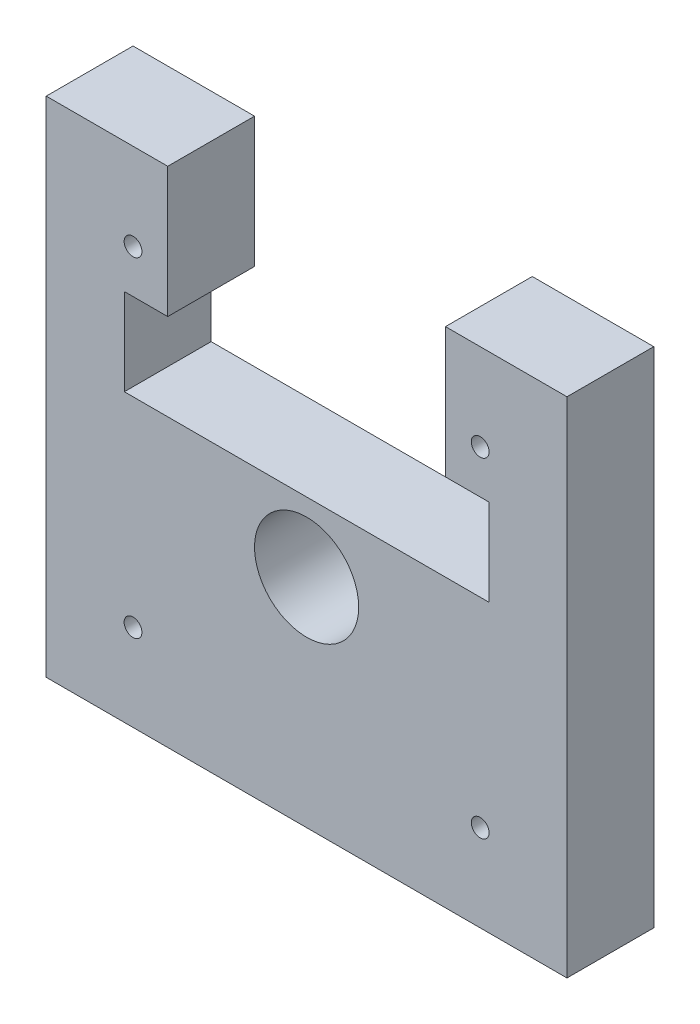
ISO-10303-21;
HEADER;
FILE_DESCRIPTION(('STEP AP214'),'2;1');
FILE_NAME('part.step','',(''),(''),'','','');
FILE_SCHEMA(('AUTOMOTIVE_DESIGN { 1 0 10303 214 1 1 1 1 }'));
ENDSEC;
DATA;
#1=APPLICATION_CONTEXT('core data for automotive mechanical design processes');
#2=APPLICATION_PROTOCOL_DEFINITION('international standard','automotive_design',2000,#1);
#3=PRODUCT_CONTEXT('',#1,'mechanical');
#4=PRODUCT('Part','Part','',(#3));
#5=PRODUCT_RELATED_PRODUCT_CATEGORY('part','',(#4));
#6=PRODUCT_DEFINITION_FORMATION('','',#4);
#7=PRODUCT_DEFINITION_CONTEXT('part definition',#1,'design');
#8=PRODUCT_DEFINITION('design','',#6,#7);
#9=PRODUCT_DEFINITION_SHAPE('','',#8);
#10=(LENGTH_UNIT() NAMED_UNIT(*) SI_UNIT(.MILLI.,.METRE.));
#11=(NAMED_UNIT(*) PLANE_ANGLE_UNIT() SI_UNIT($,.RADIAN.));
#12=(NAMED_UNIT(*) SI_UNIT($,.STERADIAN.) SOLID_ANGLE_UNIT());
#13=UNCERTAINTY_MEASURE_WITH_UNIT(LENGTH_MEASURE(1.E-05),#10,'distance_accuracy_value','');
#14=(GEOMETRIC_REPRESENTATION_CONTEXT(3) GLOBAL_UNCERTAINTY_ASSIGNED_CONTEXT((#13)) GLOBAL_UNIT_ASSIGNED_CONTEXT((#10,
#11,#12)) REPRESENTATION_CONTEXT('',''));
#15=CARTESIAN_POINT('',(0.,0.,0.));
#16=DIRECTION('',(0.,0.,1.));
#17=DIRECTION('',(1.,0.,0.));
#18=AXIS2_PLACEMENT_3D('',#15,#16,#17);
#19=CARTESIAN_POINT('',(0.,33.,10.));
#20=DIRECTION('',(0.,1.,0.));
#21=DIRECTION('',(0.,0.,1.));
#22=AXIS2_PLACEMENT_3D('',#19,#20,#21);
#23=PLANE('',#22);
#24=DIRECTION('',(1.,0.,0.));
#25=VECTOR('',#24,1.);
#26=CARTESIAN_POINT('',(0.,33.,0.));
#27=LINE('',#26,#25);
#28=CARTESIAN_POINT('',(16.,33.,0.));
#29=VERTEX_POINT('',#28);
#30=CARTESIAN_POINT('',(30.,33.,0.));
#31=VERTEX_POINT('',#30);
#32=EDGE_CURVE('E103',#29,#31,#27,.T.);
#33=ORIENTED_EDGE('',*,*,#32,.F.);
#34=DIRECTION('',(0.,0.,1.));
#35=VECTOR('',#34,1.);
#36=CARTESIAN_POINT('',(16.,33.,-1.2E-05));
#37=LINE('',#36,#35);
#38=CARTESIAN_POINT('',(16.,33.,10.));
#39=VERTEX_POINT('',#38);
#40=EDGE_CURVE('E157',#29,#39,#37,.T.);
#41=ORIENTED_EDGE('',*,*,#40,.T.);
#42=DIRECTION('',(1.,0.,0.));
#43=VECTOR('',#42,1.);
#44=CARTESIAN_POINT('',(0.,33.,10.));
#45=LINE('',#44,#43);
#46=CARTESIAN_POINT('',(30.,33.,10.));
#47=VERTEX_POINT('',#46);
#48=EDGE_CURVE('E80',#39,#47,#45,.T.);
#49=ORIENTED_EDGE('',*,*,#48,.T.);
#50=DIRECTION('',(0.,0.,-1.));
#51=VECTOR('',#50,1.);
#52=CARTESIAN_POINT('',(30.,33.,10.));
#53=LINE('',#52,#51);
#54=EDGE_CURVE('E194',#47,#31,#53,.T.);
#55=ORIENTED_EDGE('',*,*,#54,.T.);
#56=EDGE_LOOP('',(#33,#41,#49,#55));
#57=FACE_BOUND('',#56,.T.);
#58=ADVANCED_FACE('F55',(#57),#23,.T.);
#59=CARTESIAN_POINT('',(0.,0.,10.));
#60=DIRECTION('',(0.,0.,1.));
#61=DIRECTION('',(1.,0.,0.));
#62=AXIS2_PLACEMENT_3D('',#59,#60,#61);
#63=PLANE('',#62);
#64=CARTESIAN_POINT('',(20.,23.,10.));
#65=DIRECTION('',(0.,0.,1.));
#66=DIRECTION('',(1.,0.,0.));
#67=AXIS2_PLACEMENT_3D('',#64,#65,#66);
#68=CIRCLE('',#67,1.025);
#69=CARTESIAN_POINT('',(21.025,23.,10.));
#70=VERTEX_POINT('',#69);
#71=EDGE_CURVE('E284',#70,#70,#68,.T.);
#72=ORIENTED_EDGE('',*,*,#71,.F.);
#73=EDGE_LOOP('',(#72));
#74=FACE_BOUND('',#73,.T.);
#75=CARTESIAN_POINT('',(-20.,23.,10.));
#76=DIRECTION('',(0.,0.,1.));
#77=DIRECTION('',(1.,0.,0.));
#78=AXIS2_PLACEMENT_3D('',#75,#76,#77);
#79=CIRCLE('',#78,1.025);
#80=CARTESIAN_POINT('',(-18.975,23.,10.));
#81=VERTEX_POINT('',#80);
#82=EDGE_CURVE('E292',#81,#81,#79,.T.);
#83=ORIENTED_EDGE('',*,*,#82,.F.);
#84=EDGE_LOOP('',(#83));
#85=FACE_BOUND('',#84,.T.);
#86=CARTESIAN_POINT('',(-20.,-15.,10.));
#87=DIRECTION('',(0.,0.,1.));
#88=DIRECTION('',(1.,0.,0.));
#89=AXIS2_PLACEMENT_3D('',#86,#87,#88);
#90=CIRCLE('',#89,1.025);
#91=CARTESIAN_POINT('',(-18.975,-15.,10.));
#92=VERTEX_POINT('',#91);
#93=EDGE_CURVE('E300',#92,#92,#90,.T.);
#94=ORIENTED_EDGE('',*,*,#93,.F.);
#95=EDGE_LOOP('',(#94));
#96=FACE_BOUND('',#95,.T.);
#97=CARTESIAN_POINT('',(20.,-15.,10.));
#98=DIRECTION('',(0.,0.,1.));
#99=DIRECTION('',(1.,0.,0.));
#100=AXIS2_PLACEMENT_3D('',#97,#98,#99);
#101=CIRCLE('',#100,1.025);
#102=CARTESIAN_POINT('',(21.025,-15.,10.));
#103=VERTEX_POINT('',#102);
#104=EDGE_CURVE('E308',#103,#103,#101,.T.);
#105=ORIENTED_EDGE('',*,*,#104,.F.);
#106=EDGE_LOOP('',(#105));
#107=FACE_BOUND('',#106,.T.);
#108=CARTESIAN_POINT('',(0.,0.,10.));
#109=DIRECTION('',(0.,0.,1.));
#110=DIRECTION('',(1.,0.,0.));
#111=AXIS2_PLACEMENT_3D('',#108,#109,#110);
#112=CIRCLE('',#111,6.);
#113=CARTESIAN_POINT('',(6.,0.,10.));
#114=VERTEX_POINT('',#113);
#115=EDGE_CURVE('E176',#114,#114,#112,.T.);
#116=ORIENTED_EDGE('',*,*,#115,.F.);
#117=EDGE_LOOP('',(#116));
#118=FACE_BOUND('',#117,.T.);
#119=ORIENTED_EDGE('',*,*,#48,.F.);
#120=DIRECTION('',(0.,-1.,0.));
#121=VECTOR('',#120,1.);
#122=CARTESIAN_POINT('',(16.,0.,10.));
#123=LINE('',#122,#121);
#124=CARTESIAN_POINT('',(16.,18.,10.));
#125=VERTEX_POINT('',#124);
#126=EDGE_CURVE('E155',#39,#125,#123,.T.);
#127=ORIENTED_EDGE('',*,*,#126,.T.);
#128=DIRECTION('',(1.,0.,0.));
#129=VECTOR('',#128,1.);
#130=CARTESIAN_POINT('',(0.,18.,10.));
#131=LINE('',#130,#129);
#132=CARTESIAN_POINT('',(21.,18.,10.));
#133=VERTEX_POINT('',#132);
#134=EDGE_CURVE('E168',#125,#133,#131,.T.);
#135=ORIENTED_EDGE('',*,*,#134,.T.);
#136=DIRECTION('',(0.,-1.,0.));
#137=VECTOR('',#136,1.);
#138=CARTESIAN_POINT('',(21.,0.,10.));
#139=LINE('',#138,#137);
#140=CARTESIAN_POINT('',(21.,8.,10.));
#141=VERTEX_POINT('',#140);
#142=EDGE_CURVE('E254',#133,#141,#139,.T.);
#143=ORIENTED_EDGE('',*,*,#142,.T.);
#144=DIRECTION('',(1.,0.,0.));
#145=VECTOR('',#144,1.);
#146=CARTESIAN_POINT('',(0.,8.,10.));
#147=LINE('',#146,#145);
#148=CARTESIAN_POINT('',(-21.,8.,10.));
#149=VERTEX_POINT('',#148);
#150=EDGE_CURVE('E563',#149,#141,#147,.T.);
#151=ORIENTED_EDGE('',*,*,#150,.F.);
#152=DIRECTION('',(0.,-1.,0.));
#153=VECTOR('',#152,1.);
#154=CARTESIAN_POINT('',(-21.,0.,10.));
#155=LINE('',#154,#153);
#156=CARTESIAN_POINT('',(-21.,18.,10.));
#157=VERTEX_POINT('',#156);
#158=EDGE_CURVE('E270',#157,#149,#155,.T.);
#159=ORIENTED_EDGE('',*,*,#158,.F.);
#160=CARTESIAN_POINT('',(-16.,18.,10.));
#161=VERTEX_POINT('',#160);
#162=EDGE_CURVE('E560',#157,#161,#131,.T.);
#163=ORIENTED_EDGE('',*,*,#162,.T.);
#164=DIRECTION('',(0.,-1.,0.));
#165=VECTOR('',#164,1.);
#166=CARTESIAN_POINT('',(-16.,0.,10.));
#167=LINE('',#166,#165);
#168=CARTESIAN_POINT('',(-16.,33.,10.));
#169=VERTEX_POINT('',#168);
#170=EDGE_CURVE('E164',#169,#161,#167,.T.);
#171=ORIENTED_EDGE('',*,*,#170,.F.);
#172=CARTESIAN_POINT('',(-30.,33.,10.));
#173=VERTEX_POINT('',#172);
#174=EDGE_CURVE('E175',#173,#169,#45,.T.);
#175=ORIENTED_EDGE('',*,*,#174,.F.);
#176=DIRECTION('',(0.,-1.,0.));
#177=VECTOR('',#176,1.);
#178=CARTESIAN_POINT('',(-30.,0.,10.));
#179=LINE('',#178,#177);
#180=CARTESIAN_POINT('',(-30.,-25.,10.));
#181=VERTEX_POINT('',#180);
#182=EDGE_CURVE('E180',#173,#181,#179,.T.);
#183=ORIENTED_EDGE('',*,*,#182,.T.);
#184=DIRECTION('',(1.,0.,0.));
#185=VECTOR('',#184,1.);
#186=CARTESIAN_POINT('',(0.,-25.,10.));
#187=LINE('',#186,#185);
#188=CARTESIAN_POINT('',(30.,-25.,10.));
#189=VERTEX_POINT('',#188);
#190=EDGE_CURVE('E189',#181,#189,#187,.T.);
#191=ORIENTED_EDGE('',*,*,#190,.T.);
#192=DIRECTION('',(0.,-1.,0.));
#193=VECTOR('',#192,1.);
#194=CARTESIAN_POINT('',(30.,0.,10.));
#195=LINE('',#194,#193);
#196=EDGE_CURVE('E173',#47,#189,#195,.T.);
#197=ORIENTED_EDGE('',*,*,#196,.F.);
#198=EDGE_LOOP('',(#119,#127,#135,#143,#151,#159,#163,#171,#175,#183,#191,#197));
#199=FACE_BOUND('',#198,.T.);
#200=ADVANCED_FACE('F171',(#74,#85,#96,#107,#118,#199),#63,.T.);
#201=CARTESIAN_POINT('',(0.,0.,0.));
#202=DIRECTION('',(0.,0.,1.));
#203=DIRECTION('',(1.,0.,0.));
#204=AXIS2_PLACEMENT_3D('',#201,#202,#203);
#205=PLANE('',#204);
#206=CARTESIAN_POINT('',(0.,0.,0.));
#207=DIRECTION('',(0.,0.,1.));
#208=DIRECTION('',(1.,0.,0.));
#209=AXIS2_PLACEMENT_3D('',#206,#207,#208);
#210=CIRCLE('',#209,6.);
#211=CARTESIAN_POINT('',(6.,0.,0.));
#212=VERTEX_POINT('',#211);
#213=EDGE_CURVE('E195',#212,#212,#210,.T.);
#214=ORIENTED_EDGE('',*,*,#213,.T.);
#215=EDGE_LOOP('',(#214));
#216=FACE_BOUND('',#215,.T.);
#217=CARTESIAN_POINT('',(20.,-15.,0.));
#218=DIRECTION('',(0.,0.,1.));
#219=DIRECTION('',(1.,0.,0.));
#220=AXIS2_PLACEMENT_3D('',#217,#218,#219);
#221=CIRCLE('',#220,1.025);
#222=CARTESIAN_POINT('',(21.025,-15.,0.));
#223=VERTEX_POINT('',#222);
#224=EDGE_CURVE('E199',#223,#223,#221,.T.);
#225=ORIENTED_EDGE('',*,*,#224,.T.);
#226=EDGE_LOOP('',(#225));
#227=FACE_BOUND('',#226,.T.);
#228=CARTESIAN_POINT('',(-20.,-15.,0.));
#229=DIRECTION('',(0.,0.,1.));
#230=DIRECTION('',(1.,0.,0.));
#231=AXIS2_PLACEMENT_3D('',#228,#229,#230);
#232=CIRCLE('',#231,1.025);
#233=CARTESIAN_POINT('',(-18.975,-15.,0.));
#234=VERTEX_POINT('',#233);
#235=EDGE_CURVE('E304',#234,#234,#232,.T.);
#236=ORIENTED_EDGE('',*,*,#235,.T.);
#237=EDGE_LOOP('',(#236));
#238=FACE_BOUND('',#237,.T.);
#239=CARTESIAN_POINT('',(-20.,23.,0.));
#240=DIRECTION('',(0.,0.,1.));
#241=DIRECTION('',(1.,0.,0.));
#242=AXIS2_PLACEMENT_3D('',#239,#240,#241);
#243=CIRCLE('',#242,1.025);
#244=CARTESIAN_POINT('',(-18.975,23.,0.));
#245=VERTEX_POINT('',#244);
#246=EDGE_CURVE('E296',#245,#245,#243,.T.);
#247=ORIENTED_EDGE('',*,*,#246,.T.);
#248=EDGE_LOOP('',(#247));
#249=FACE_BOUND('',#248,.T.);
#250=CARTESIAN_POINT('',(20.,23.,0.));
#251=DIRECTION('',(0.,0.,1.));
#252=DIRECTION('',(1.,0.,0.));
#253=AXIS2_PLACEMENT_3D('',#250,#251,#252);
#254=CIRCLE('',#253,1.025);
#255=CARTESIAN_POINT('',(21.025,23.,0.));
#256=VERTEX_POINT('',#255);
#257=EDGE_CURVE('E288',#256,#256,#254,.T.);
#258=ORIENTED_EDGE('',*,*,#257,.T.);
#259=EDGE_LOOP('',(#258));
#260=FACE_BOUND('',#259,.T.);
#261=DIRECTION('',(0.,-1.,0.));
#262=VECTOR('',#261,1.);
#263=CARTESIAN_POINT('',(16.,0.,0.));
#264=LINE('',#263,#262);
#265=CARTESIAN_POINT('',(16.,18.,0.));
#266=VERTEX_POINT('',#265);
#267=EDGE_CURVE('E11',#29,#266,#264,.T.);
#268=ORIENTED_EDGE('',*,*,#267,.F.);
#269=ORIENTED_EDGE('',*,*,#32,.T.);
#270=DIRECTION('',(0.,-1.,0.));
#271=VECTOR('',#270,1.);
#272=CARTESIAN_POINT('',(30.,0.,0.));
#273=LINE('',#272,#271);
#274=CARTESIAN_POINT('',(30.,-25.,0.));
#275=VERTEX_POINT('',#274);
#276=EDGE_CURVE('E182',#31,#275,#273,.T.);
#277=ORIENTED_EDGE('',*,*,#276,.T.);
#278=DIRECTION('',(1.,0.,0.));
#279=VECTOR('',#278,1.);
#280=CARTESIAN_POINT('',(0.,-25.,0.));
#281=LINE('',#280,#279);
#282=CARTESIAN_POINT('',(-30.,-25.,0.));
#283=VERTEX_POINT('',#282);
#284=EDGE_CURVE('E208',#283,#275,#281,.T.);
#285=ORIENTED_EDGE('',*,*,#284,.F.);
#286=DIRECTION('',(0.,-1.,0.));
#287=VECTOR('',#286,1.);
#288=CARTESIAN_POINT('',(-30.,0.,0.));
#289=LINE('',#288,#287);
#290=CARTESIAN_POINT('',(-30.,33.,0.));
#291=VERTEX_POINT('',#290);
#292=EDGE_CURVE('E204',#291,#283,#289,.T.);
#293=ORIENTED_EDGE('',*,*,#292,.F.);
#294=CARTESIAN_POINT('',(-16.,33.,0.));
#295=VERTEX_POINT('',#294);
#296=EDGE_CURVE('E200',#291,#295,#27,.T.);
#297=ORIENTED_EDGE('',*,*,#296,.T.);
#298=DIRECTION('',(0.,-1.,0.));
#299=VECTOR('',#298,1.);
#300=CARTESIAN_POINT('',(-16.,0.,0.));
#301=LINE('',#300,#299);
#302=CARTESIAN_POINT('',(-16.,18.,0.));
#303=VERTEX_POINT('',#302);
#304=EDGE_CURVE('E225',#295,#303,#301,.T.);
#305=ORIENTED_EDGE('',*,*,#304,.T.);
#306=DIRECTION('',(1.,0.,0.));
#307=VECTOR('',#306,1.);
#308=CARTESIAN_POINT('',(0.,18.,0.));
#309=LINE('',#308,#307);
#310=CARTESIAN_POINT('',(-21.,18.,0.));
#311=VERTEX_POINT('',#310);
#312=EDGE_CURVE('E229',#311,#303,#309,.T.);
#313=ORIENTED_EDGE('',*,*,#312,.F.);
#314=DIRECTION('',(0.,-1.,0.));
#315=VECTOR('',#314,1.);
#316=CARTESIAN_POINT('',(-21.,0.,0.));
#317=LINE('',#316,#315);
#318=CARTESIAN_POINT('',(-21.,8.,0.));
#319=VERTEX_POINT('',#318);
#320=EDGE_CURVE('E232',#311,#319,#317,.T.);
#321=ORIENTED_EDGE('',*,*,#320,.T.);
#322=DIRECTION('',(1.,0.,0.));
#323=VECTOR('',#322,1.);
#324=CARTESIAN_POINT('',(0.,8.,0.));
#325=LINE('',#324,#323);
#326=CARTESIAN_POINT('',(21.,8.,0.));
#327=VERTEX_POINT('',#326);
#328=EDGE_CURVE('E236',#319,#327,#325,.T.);
#329=ORIENTED_EDGE('',*,*,#328,.T.);
#330=DIRECTION('',(0.,-1.,0.));
#331=VECTOR('',#330,1.);
#332=CARTESIAN_POINT('',(21.,0.,0.));
#333=LINE('',#332,#331);
#334=CARTESIAN_POINT('',(21.,18.,0.));
#335=VERTEX_POINT('',#334);
#336=EDGE_CURVE('E240',#335,#327,#333,.T.);
#337=ORIENTED_EDGE('',*,*,#336,.F.);
#338=DIRECTION('',(1.,0.,0.));
#339=VECTOR('',#338,1.);
#340=CARTESIAN_POINT('',(0.,18.,0.));
#341=LINE('',#340,#339);
#342=EDGE_CURVE('E64',#266,#335,#341,.T.);
#343=ORIENTED_EDGE('',*,*,#342,.F.);
#344=EDGE_LOOP('',(#268,#269,#277,#285,#293,#297,#305,#313,#321,#329,#337,#343));
#345=FACE_BOUND('',#344,.T.);
#346=ADVANCED_FACE('F258',(#216,#227,#238,#249,#260,#345),#205,.F.);
#347=DIRECTION('',(0.,0.,1.));
#348=VECTOR('',#347,1.);
#349=CARTESIAN_POINT('',(-16.,33.,-1.2E-05));
#350=LINE('',#349,#348);
#351=EDGE_CURVE('E167',#295,#169,#350,.T.);
#352=ORIENTED_EDGE('',*,*,#351,.F.);
#353=ORIENTED_EDGE('',*,*,#296,.F.);
#354=DIRECTION('',(0.,0.,-1.));
#355=VECTOR('',#354,1.);
#356=CARTESIAN_POINT('',(-30.,33.,10.));
#357=LINE('',#356,#355);
#358=EDGE_CURVE('E109',#173,#291,#357,.T.);
#359=ORIENTED_EDGE('',*,*,#358,.F.);
#360=ORIENTED_EDGE('',*,*,#174,.T.);
#361=EDGE_LOOP('',(#352,#353,#359,#360));
#362=FACE_BOUND('',#361,.T.);
#363=ADVANCED_FACE('F337',(#362),#23,.T.);
#364=CARTESIAN_POINT('',(-30.,0.,10.));
#365=DIRECTION('',(1.,0.,0.));
#366=DIRECTION('',(0.,0.,-1.));
#367=AXIS2_PLACEMENT_3D('',#364,#365,#366);
#368=PLANE('',#367);
#369=ORIENTED_EDGE('',*,*,#292,.T.);
#370=DIRECTION('',(0.,0.,-1.));
#371=VECTOR('',#370,1.);
#372=CARTESIAN_POINT('',(-30.,-25.,10.));
#373=LINE('',#372,#371);
#374=EDGE_CURVE('E219',#181,#283,#373,.T.);
#375=ORIENTED_EDGE('',*,*,#374,.F.);
#376=ORIENTED_EDGE('',*,*,#182,.F.);
#377=ORIENTED_EDGE('',*,*,#358,.T.);
#378=EDGE_LOOP('',(#369,#375,#376,#377));
#379=FACE_BOUND('',#378,.T.);
#380=ADVANCED_FACE('F342',(#379),#368,.F.);
#381=CARTESIAN_POINT('',(0.,-25.,10.));
#382=DIRECTION('',(0.,1.,0.));
#383=DIRECTION('',(0.,0.,1.));
#384=AXIS2_PLACEMENT_3D('',#381,#382,#383);
#385=PLANE('',#384);
#386=ORIENTED_EDGE('',*,*,#284,.T.);
#387=DIRECTION('',(0.,0.,-1.));
#388=VECTOR('',#387,1.);
#389=CARTESIAN_POINT('',(30.,-25.,10.));
#390=LINE('',#389,#388);
#391=EDGE_CURVE('E216',#189,#275,#390,.T.);
#392=ORIENTED_EDGE('',*,*,#391,.F.);
#393=ORIENTED_EDGE('',*,*,#190,.F.);
#394=ORIENTED_EDGE('',*,*,#374,.T.);
#395=EDGE_LOOP('',(#386,#392,#393,#394));
#396=FACE_BOUND('',#395,.T.);
#397=ADVANCED_FACE('F333',(#396),#385,.F.);
#398=CARTESIAN_POINT('',(0.,0.,10.));
#399=DIRECTION('',(0.,0.,-1.));
#400=DIRECTION('',(-1.,0.,0.));
#401=AXIS2_PLACEMENT_3D('',#398,#399,#400);
#402=CYLINDRICAL_SURFACE('',#401,6.);
#403=ORIENTED_EDGE('',*,*,#115,.T.);
#404=EDGE_LOOP('',(#403));
#405=FACE_BOUND('',#404,.T.);
#406=ORIENTED_EDGE('',*,*,#213,.F.);
#407=EDGE_LOOP('',(#406));
#408=FACE_BOUND('',#407,.T.);
#409=ADVANCED_FACE('F57',(#405,#408),#402,.F.);
#410=CARTESIAN_POINT('',(30.,0.,10.));
#411=DIRECTION('',(1.,0.,0.));
#412=DIRECTION('',(0.,0.,-1.));
#413=AXIS2_PLACEMENT_3D('',#410,#411,#412);
#414=PLANE('',#413);
#415=ORIENTED_EDGE('',*,*,#276,.F.);
#416=ORIENTED_EDGE('',*,*,#54,.F.);
#417=ORIENTED_EDGE('',*,*,#196,.T.);
#418=ORIENTED_EDGE('',*,*,#391,.T.);
#419=EDGE_LOOP('',(#415,#416,#417,#418));
#420=FACE_BOUND('',#419,.T.);
#421=ADVANCED_FACE('F321',(#420),#414,.T.);
#422=CARTESIAN_POINT('',(20.,-15.,10.));
#423=DIRECTION('',(0.,0.,1.));
#424=DIRECTION('',(1.,0.,0.));
#425=AXIS2_PLACEMENT_3D('',#422,#423,#424);
#426=CYLINDRICAL_SURFACE('',#425,1.025);
#427=ORIENTED_EDGE('',*,*,#224,.F.);
#428=EDGE_LOOP('',(#427));
#429=FACE_BOUND('',#428,.T.);
#430=ORIENTED_EDGE('',*,*,#104,.T.);
#431=EDGE_LOOP('',(#430));
#432=FACE_BOUND('',#431,.T.);
#433=ADVANCED_FACE('F317',(#429,#432),#426,.F.);
#434=CARTESIAN_POINT('',(-20.,-15.,10.));
#435=DIRECTION('',(0.,0.,1.));
#436=DIRECTION('',(1.,0.,0.));
#437=AXIS2_PLACEMENT_3D('',#434,#435,#436);
#438=CYLINDRICAL_SURFACE('',#437,1.025);
#439=ORIENTED_EDGE('',*,*,#235,.F.);
#440=EDGE_LOOP('',(#439));
#441=FACE_BOUND('',#440,.T.);
#442=ORIENTED_EDGE('',*,*,#93,.T.);
#443=EDGE_LOOP('',(#442));
#444=FACE_BOUND('',#443,.T.);
#445=ADVANCED_FACE('F320',(#441,#444),#438,.F.);
#446=CARTESIAN_POINT('',(-20.,23.,10.));
#447=DIRECTION('',(0.,0.,1.));
#448=DIRECTION('',(1.,0.,0.));
#449=AXIS2_PLACEMENT_3D('',#446,#447,#448);
#450=CYLINDRICAL_SURFACE('',#449,1.025);
#451=ORIENTED_EDGE('',*,*,#246,.F.);
#452=EDGE_LOOP('',(#451));
#453=FACE_BOUND('',#452,.T.);
#454=ORIENTED_EDGE('',*,*,#82,.T.);
#455=EDGE_LOOP('',(#454));
#456=FACE_BOUND('',#455,.T.);
#457=ADVANCED_FACE('F384',(#453,#456),#450,.F.);
#458=CARTESIAN_POINT('',(20.,23.,10.));
#459=DIRECTION('',(0.,0.,1.));
#460=DIRECTION('',(1.,0.,0.));
#461=AXIS2_PLACEMENT_3D('',#458,#459,#460);
#462=CYLINDRICAL_SURFACE('',#461,1.025);
#463=ORIENTED_EDGE('',*,*,#257,.F.);
#464=EDGE_LOOP('',(#463));
#465=FACE_BOUND('',#464,.T.);
#466=ORIENTED_EDGE('',*,*,#71,.T.);
#467=EDGE_LOOP('',(#466));
#468=FACE_BOUND('',#467,.T.);
#469=ADVANCED_FACE('F381',(#465,#468),#462,.F.);
#470=CARTESIAN_POINT('',(16.,0.,-1.2E-05));
#471=DIRECTION('',(-1.,0.,0.));
#472=DIRECTION('',(0.,0.,1.));
#473=AXIS2_PLACEMENT_3D('',#470,#471,#472);
#474=PLANE('',#473);
#475=ORIENTED_EDGE('',*,*,#267,.T.);
#476=DIRECTION('',(0.,0.,1.));
#477=VECTOR('',#476,1.);
#478=CARTESIAN_POINT('',(16.,18.,-1.2E-05));
#479=LINE('',#478,#477);
#480=EDGE_CURVE('E159',#266,#125,#479,.T.);
#481=ORIENTED_EDGE('',*,*,#480,.T.);
#482=ORIENTED_EDGE('',*,*,#126,.F.);
#483=ORIENTED_EDGE('',*,*,#40,.F.);
#484=EDGE_LOOP('',(#475,#481,#482,#483));
#485=FACE_BOUND('',#484,.T.);
#486=ADVANCED_FACE('F156',(#485),#474,.T.);
#487=CARTESIAN_POINT('',(0.,18.,-1.2E-05));
#488=DIRECTION('',(0.,-1.,0.));
#489=DIRECTION('',(0.,0.,-1.));
#490=AXIS2_PLACEMENT_3D('',#487,#488,#489);
#491=PLANE('',#490);
#492=ORIENTED_EDGE('',*,*,#342,.T.);
#493=DIRECTION('',(0.,0.,1.));
#494=VECTOR('',#493,1.);
#495=CARTESIAN_POINT('',(21.,18.,-1.2E-05));
#496=LINE('',#495,#494);
#497=EDGE_CURVE('E247',#335,#133,#496,.T.);
#498=ORIENTED_EDGE('',*,*,#497,.T.);
#499=ORIENTED_EDGE('',*,*,#134,.F.);
#500=ORIENTED_EDGE('',*,*,#480,.F.);
#501=EDGE_LOOP('',(#492,#498,#499,#500));
#502=FACE_BOUND('',#501,.T.);
#503=ADVANCED_FACE('F246',(#502),#491,.T.);
#504=CARTESIAN_POINT('',(21.,0.,-1.2E-05));
#505=DIRECTION('',(-1.,0.,0.));
#506=DIRECTION('',(0.,0.,1.));
#507=AXIS2_PLACEMENT_3D('',#504,#505,#506);
#508=PLANE('',#507);
#509=ORIENTED_EDGE('',*,*,#336,.T.);
#510=DIRECTION('',(0.,0.,1.));
#511=VECTOR('',#510,1.);
#512=CARTESIAN_POINT('',(21.,8.,-1.2E-05));
#513=LINE('',#512,#511);
#514=EDGE_CURVE('E256',#327,#141,#513,.T.);
#515=ORIENTED_EDGE('',*,*,#514,.T.);
#516=ORIENTED_EDGE('',*,*,#142,.F.);
#517=ORIENTED_EDGE('',*,*,#497,.F.);
#518=EDGE_LOOP('',(#509,#515,#516,#517));
#519=FACE_BOUND('',#518,.T.);
#520=ADVANCED_FACE('F251',(#519),#508,.T.);
#521=CARTESIAN_POINT('',(0.,8.,-1.2E-05));
#522=DIRECTION('',(0.,-1.,0.));
#523=DIRECTION('',(0.,0.,-1.));
#524=AXIS2_PLACEMENT_3D('',#521,#522,#523);
#525=PLANE('',#524);
#526=DIRECTION('',(0.,0.,1.));
#527=VECTOR('',#526,1.);
#528=CARTESIAN_POINT('',(-21.,8.,-1.2E-05));
#529=LINE('',#528,#527);
#530=EDGE_CURVE('E264',#319,#149,#529,.T.);
#531=ORIENTED_EDGE('',*,*,#530,.T.);
#532=ORIENTED_EDGE('',*,*,#150,.T.);
#533=ORIENTED_EDGE('',*,*,#514,.F.);
#534=ORIENTED_EDGE('',*,*,#328,.F.);
#535=EDGE_LOOP('',(#531,#532,#533,#534));
#536=FACE_BOUND('',#535,.T.);
#537=ADVANCED_FACE('F262',(#536),#525,.F.);
#538=CARTESIAN_POINT('',(-21.,0.,-1.2E-05));
#539=DIRECTION('',(-1.,0.,0.));
#540=DIRECTION('',(0.,0.,1.));
#541=AXIS2_PLACEMENT_3D('',#538,#539,#540);
#542=PLANE('',#541);
#543=DIRECTION('',(0.,0.,1.));
#544=VECTOR('',#543,1.);
#545=CARTESIAN_POINT('',(-21.,18.,-1.2E-05));
#546=LINE('',#545,#544);
#547=EDGE_CURVE('E273',#311,#157,#546,.T.);
#548=ORIENTED_EDGE('',*,*,#547,.T.);
#549=ORIENTED_EDGE('',*,*,#158,.T.);
#550=ORIENTED_EDGE('',*,*,#530,.F.);
#551=ORIENTED_EDGE('',*,*,#320,.F.);
#552=EDGE_LOOP('',(#548,#549,#550,#551));
#553=FACE_BOUND('',#552,.T.);
#554=ADVANCED_FACE('F267',(#553),#542,.F.);
#555=ORIENTED_EDGE('',*,*,#312,.T.);
#556=DIRECTION('',(0.,0.,1.));
#557=VECTOR('',#556,1.);
#558=CARTESIAN_POINT('',(-16.,18.,-1.2E-05));
#559=LINE('',#558,#557);
#560=EDGE_CURVE('E71',#303,#161,#559,.T.);
#561=ORIENTED_EDGE('',*,*,#560,.T.);
#562=ORIENTED_EDGE('',*,*,#162,.F.);
#563=ORIENTED_EDGE('',*,*,#547,.F.);
#564=EDGE_LOOP('',(#555,#561,#562,#563));
#565=FACE_BOUND('',#564,.T.);
#566=ADVANCED_FACE('F369',(#565),#491,.T.);
#567=CARTESIAN_POINT('',(-16.,0.,-1.2E-05));
#568=DIRECTION('',(-1.,0.,0.));
#569=DIRECTION('',(0.,0.,1.));
#570=AXIS2_PLACEMENT_3D('',#567,#568,#569);
#571=PLANE('',#570);
#572=ORIENTED_EDGE('',*,*,#351,.T.);
#573=ORIENTED_EDGE('',*,*,#170,.T.);
#574=ORIENTED_EDGE('',*,*,#560,.F.);
#575=ORIENTED_EDGE('',*,*,#304,.F.);
#576=EDGE_LOOP('',(#572,#573,#574,#575));
#577=FACE_BOUND('',#576,.T.);
#578=ADVANCED_FACE('F367',(#577),#571,.F.);
#579=CLOSED_SHELL('',(#58,#200,#346,#363,#380,#397,#409,#421,#433,#445,#457,#469,#486,#503,#520,
#537,#554,#566,#578));
#580=MANIFOLD_SOLID_BREP('B2',#579);
#581=ADVANCED_BREP_SHAPE_REPRESENTATION('',(#18,#580),#14);
#582=SHAPE_DEFINITION_REPRESENTATION(#9,#581);
ENDSEC;
END-ISO-10303-21;
